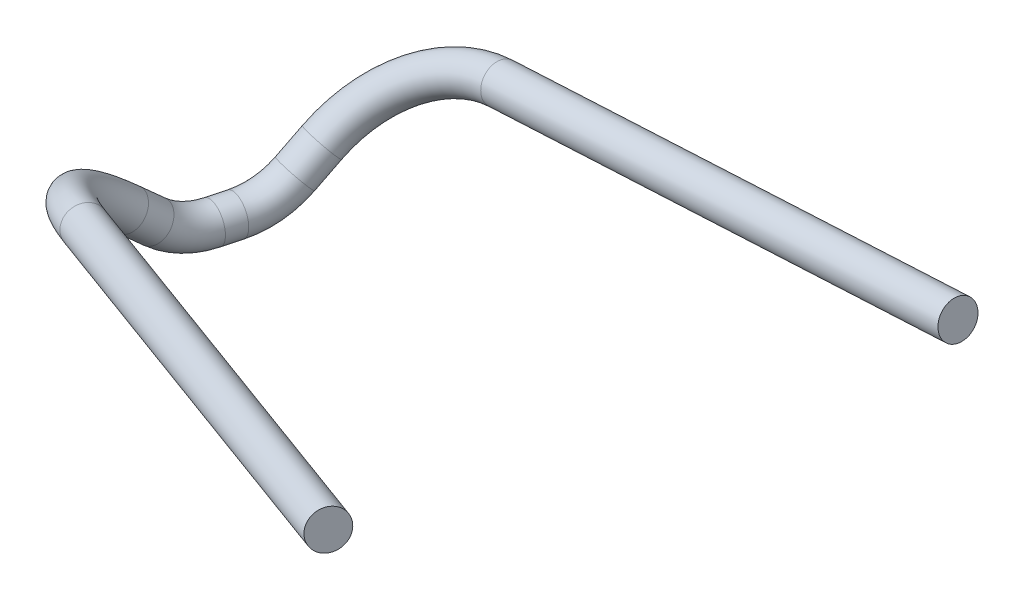
ISO-10303-21;
HEADER;
FILE_DESCRIPTION(('STEP AP214'),'2;1');
FILE_NAME('part.step','',(''),(''),'','','');
FILE_SCHEMA(('AUTOMOTIVE_DESIGN { 1 0 10303 214 1 1 1 1 }'));
ENDSEC;
DATA;
#1=APPLICATION_CONTEXT('core data for automotive mechanical design processes');
#2=APPLICATION_PROTOCOL_DEFINITION('international standard','automotive_design',2000,#1);
#3=PRODUCT_CONTEXT('',#1,'mechanical');
#4=PRODUCT('Part','Part','',(#3));
#5=PRODUCT_RELATED_PRODUCT_CATEGORY('part','',(#4));
#6=PRODUCT_DEFINITION_FORMATION('','',#4);
#7=PRODUCT_DEFINITION_CONTEXT('part definition',#1,'design');
#8=PRODUCT_DEFINITION('design','',#6,#7);
#9=PRODUCT_DEFINITION_SHAPE('','',#8);
#10=(LENGTH_UNIT() NAMED_UNIT(*) SI_UNIT(.MILLI.,.METRE.));
#11=(NAMED_UNIT(*) PLANE_ANGLE_UNIT() SI_UNIT($,.RADIAN.));
#12=(NAMED_UNIT(*) SI_UNIT($,.STERADIAN.) SOLID_ANGLE_UNIT());
#13=UNCERTAINTY_MEASURE_WITH_UNIT(LENGTH_MEASURE(1.E-05),#10,'distance_accuracy_value','');
#14=(GEOMETRIC_REPRESENTATION_CONTEXT(3) GLOBAL_UNCERTAINTY_ASSIGNED_CONTEXT((#13)) GLOBAL_UNIT_ASSIGNED_CONTEXT((#10,
#11,#12)) REPRESENTATION_CONTEXT('',''));
#15=CARTESIAN_POINT('',(0.,0.,0.));
#16=DIRECTION('',(0.,0.,1.));
#17=DIRECTION('',(1.,0.,0.));
#18=AXIS2_PLACEMENT_3D('',#15,#16,#17);
#19=CARTESIAN_POINT('',(-78.0843485405473,-0.522963162736968,86.9618786306305));
#20=DIRECTION('',(0.89717440141334,0.141581533037502,0.418369170651191));
#21=DIRECTION('',(0.128206233000635,-0.989926564709335,0.0600712768514311));
#22=AXIS2_PLACEMENT_3D('',#19,#20,#21);
#23=PLANE('',#22);
#24=CARTESIAN_POINT('',(-78.0843485405473,-0.522963162736968,86.9618786306305));
#25=DIRECTION('',(0.89717440141334,0.141581533037502,0.418369170651191));
#26=DIRECTION('',(0.128206233000635,-0.989926564709335,0.0600712768514311));
#27=AXIS2_PLACEMENT_3D('',#24,#25,#26);
#28=CIRCLE('',#27,0.749999999999999);
#29=CARTESIAN_POINT('',(-77.9881938657968,-1.26540808626897,87.0069320882691));
#30=VERTEX_POINT('',#29);
#31=EDGE_CURVE('E83',#30,#30,#28,.T.);
#32=ORIENTED_EDGE('',*,*,#31,.T.);
#33=EDGE_LOOP('',(#32));
#34=FACE_BOUND('',#33,.T.);
#35=ADVANCED_FACE('F49',(#34),#23,.T.);
#36=CARTESIAN_POINT('',(-72.6491485933944,-0.522963162736745,66.67743627856));
#37=DIRECTION('',(-0.987064277400173,-0.13431820282712,-0.087537035989163));
#38=DIRECTION('',(0.134835801640414,-0.990867956185882,0.));
#39=AXIS2_PLACEMENT_3D('',#36,#37,#38);
#40=PLANE('',#39);
#41=CARTESIAN_POINT('',(-72.6491485933944,-0.522963162736745,66.67743627856));
#42=DIRECTION('',(-0.987064277400173,-0.13431820282712,-0.087537035989163));
#43=DIRECTION('',(0.134835801640414,-0.990867956185882,0.));
#44=AXIS2_PLACEMENT_3D('',#41,#42,#43);
#45=CIRCLE('',#44,0.749999999999999);
#46=CARTESIAN_POINT('',(-72.5480217421641,-1.26611412987616,66.67743627856));
#47=VERTEX_POINT('',#46);
#48=EDGE_CURVE('E11',#47,#47,#45,.T.);
#49=ORIENTED_EDGE('',*,*,#48,.F.);
#50=EDGE_LOOP('',(#49));
#51=FACE_BOUND('',#50,.T.);
#52=ADVANCED_FACE('F91',(#51),#40,.F.);
#53=CARTESIAN_POINT('',(-78.0843485405473,-0.522963162736968,86.9618786306305));
#54=DIRECTION('',(-0.897174401413341,-0.141581533037501,-0.418369170651191));
#55=DIRECTION('',(-0.422626456830694,0.,0.906303965558318));
#56=AXIS2_PLACEMENT_3D('',#53,#54,#55);
#57=CYLINDRICAL_SURFACE('',#56,0.749999999999999);
#58=CARTESIAN_POINT('',(-96.7607761205493,-3.4702577403297,78.2527118230807));
#59=DIRECTION('',(0.89717440141334,0.141581533037502,0.418369170651191));
#60=DIRECTION('',(0.128206233000635,-0.989926564709335,0.0600712768514311));
#61=AXIS2_PLACEMENT_3D('',#58,#59,#60);
#62=CIRCLE('',#61,0.749999999999999);
#63=CARTESIAN_POINT('',(-97.0667856585665,-2.9989681134848,78.749445403857));
#64=VERTEX_POINT('',#63);
#65=EDGE_CURVE('E80',#64,#64,#62,.T.);
#66=ORIENTED_EDGE('',*,*,#65,.T.);
#67=EDGE_LOOP('',(#66));
#68=FACE_BOUND('',#67,.T.);
#69=ORIENTED_EDGE('',*,*,#31,.F.);
#70=EDGE_LOOP('',(#69));
#71=FACE_BOUND('',#70,.T.);
#72=ADVANCED_FACE('F88',(#68,#71),#57,.T.);
#73=CARTESIAN_POINT('',(-94.7207125337679,-6.61218858596242,74.9411546179051));
#74=DIRECTION('',(-0.169126331256122,-0.764908812835371,0.621539051164629));
#75=DIRECTION('',(0.,-0.630623574035153,-0.776088853077488));
#76=AXIS2_PLACEMENT_3D('',#73,#74,#75);
#77=TOROIDAL_SURFACE('',#76,4.99999999999999,0.749999999999999);
#78=CARTESIAN_POINT('',(-99.5482448831357,-6.60263734043155,73.6392943375694));
#79=DIRECTION('',(-0.197973585884879,0.644135745782778,0.738847481078975));
#80=DIRECTION('',(0.481980641490084,-0.592377449517736,0.645587808537048));
#81=AXIS2_PLACEMENT_3D('',#78,#79,#80);
#82=CIRCLE('',#81,0.749999999999999);
#83=CARTESIAN_POINT('',(-100.272374735541,-6.60120465360192,73.4440152955191));
#84=VERTEX_POINT('',#83);
#85=EDGE_CURVE('E77',#84,#84,#82,.T.);
#86=CARTESIAN_POINT('',(-94.7207125337679,-6.61218858596242,74.9411546179051));
#87=DIRECTION('',(-0.169126331256122,-0.764908812835371,0.621539051164629));
#88=DIRECTION('',(0.,-0.630623574035153,-0.776088853077488));
#89=AXIS2_PLACEMENT_3D('',#86,#87,#88);
#90=CIRCLE('',#89,5.74999999999999);
#91=EDGE_CURVE('',#64,#84,#90,.T.);
#92=ORIENTED_EDGE('',*,*,#65,.F.);
#93=ORIENTED_EDGE('',*,*,#85,.T.);
#94=ORIENTED_EDGE('',*,*,#91,.T.);
#95=ORIENTED_EDGE('',*,*,#91,.F.);
#96=EDGE_LOOP('',(#92,#94,#93,#95));
#97=FACE_BOUND('',#96,.T.);
#98=ADVANCED_FACE('F90',(#97),#77,.T.);
#99=CARTESIAN_POINT('',(-99.5482448831357,-6.60263734043157,73.6392943375695));
#100=DIRECTION('',(0.197973585884887,-0.644135745782779,-0.738847481078972));
#101=DIRECTION('',(0.,0.753766513911076,-0.657142330478218));
#102=AXIS2_PLACEMENT_3D('',#99,#100,#101);
#103=CYLINDRICAL_SURFACE('',#102,0.749999999999999);
#104=CARTESIAN_POINT('',(-99.3284730760856,-7.31769675708799,72.8190947875874));
#105=DIRECTION('',(-0.197973585884887,0.644135745782779,0.738847481078972));
#106=DIRECTION('',(0.481980641490083,-0.592377449517732,0.645587808537053));
#107=AXIS2_PLACEMENT_3D('',#104,#105,#106);
#108=CIRCLE('',#107,0.749999999999999);
#109=CARTESIAN_POINT('',(-99.4535090250655,-7.89138015567576,73.2857353019531));
#110=VERTEX_POINT('',#109);
#111=EDGE_CURVE('E74',#110,#110,#108,.T.);
#112=ORIENTED_EDGE('',*,*,#111,.T.);
#113=EDGE_LOOP('',(#112));
#114=FACE_BOUND('',#113,.T.);
#115=ORIENTED_EDGE('',*,*,#85,.F.);
#116=EDGE_LOOP('',(#115));
#117=FACE_BOUND('',#116,.T.);
#118=ADVANCED_FACE('F98',(#114,#117),#103,.T.);
#119=CARTESIAN_POINT('',(-98.828329280166,-5.02296316273685,70.9525327301247));
#120=DIRECTION('',(0.965925826289071,0.,0.258819045102512));
#121=DIRECTION('',(0.258819045102512,0.,-0.965925826289071));
#122=AXIS2_PLACEMENT_3D('',#119,#120,#121);
#123=TOROIDAL_SURFACE('',#122,2.99999999999999,0.749999999999999);
#124=CARTESIAN_POINT('',(-98.8283292801659,-8.02296316273685,70.9525327301247));
#125=DIRECTION('',(-0.258819045102513,0.,0.96592582628907));
#126=DIRECTION('',(0.611091012710674,-0.774439504841824,0.163741343357724));
#127=AXIS2_PLACEMENT_3D('',#124,#125,#126);
#128=CIRCLE('',#127,0.749999999999999);
#129=CARTESIAN_POINT('',(-98.8283292801659,-8.77296316273684,70.9525327301247));
#130=VERTEX_POINT('',#129);
#131=EDGE_CURVE('E71',#130,#130,#128,.T.);
#132=CARTESIAN_POINT('',(-98.828329280166,-5.02296316273685,70.9525327301247));
#133=DIRECTION('',(0.965925826289071,0.,0.258819045102512));
#134=DIRECTION('',(0.258819045102512,0.,-0.965925826289071));
#135=AXIS2_PLACEMENT_3D('',#132,#133,#134);
#136=CIRCLE('',#135,3.74999999999999);
#137=EDGE_CURVE('',#110,#130,#136,.T.);
#138=ORIENTED_EDGE('',*,*,#111,.F.);
#139=ORIENTED_EDGE('',*,*,#131,.T.);
#140=ORIENTED_EDGE('',*,*,#137,.T.);
#141=ORIENTED_EDGE('',*,*,#137,.F.);
#142=EDGE_LOOP('',(#138,#140,#139,#141));
#143=FACE_BOUND('',#142,.T.);
#144=ADVANCED_FACE('F123',(#143),#123,.T.);
#145=CARTESIAN_POINT('',(-98.8283292801659,-8.02296316273685,70.9525327301247));
#146=DIRECTION('',(0.258819045102514,0.,-0.96592582628907));
#147=DIRECTION('',(-0.96592582628907,0.,-0.258819045102514));
#148=AXIS2_PLACEMENT_3D('',#145,#146,#147);
#149=CYLINDRICAL_SURFACE('',#148,0.749999999999999);
#150=CARTESIAN_POINT('',(-98.6271221043037,-8.02296316273684,70.2016173269593));
#151=DIRECTION('',(-0.258819045102515,0.,0.96592582628907));
#152=DIRECTION('',(0.611091012710672,-0.774439504841824,0.16374134335773));
#153=AXIS2_PLACEMENT_3D('',#150,#151,#152);
#154=CIRCLE('',#153,0.749999999999999);
#155=CARTESIAN_POINT('',(-98.6271221043037,-8.77296316273683,70.2016173269592));
#156=VERTEX_POINT('',#155);
#157=EDGE_CURVE('E68',#156,#156,#154,.T.);
#158=ORIENTED_EDGE('',*,*,#157,.T.);
#159=EDGE_LOOP('',(#158));
#160=FACE_BOUND('',#159,.T.);
#161=ORIENTED_EDGE('',*,*,#131,.F.);
#162=EDGE_LOOP('',(#161));
#163=FACE_BOUND('',#162,.T.);
#164=ADVANCED_FACE('F119',(#160,#163),#149,.T.);
#165=CARTESIAN_POINT('',(-98.6271221043037,-5.02296316273684,70.2016173269593));
#166=DIRECTION('',(0.965925826289071,0.,0.258819045102512));
#167=DIRECTION('',(0.258819045102512,0.,-0.965925826289071));
#168=AXIS2_PLACEMENT_3D('',#165,#166,#167);
#169=TOROIDAL_SURFACE('',#168,2.99999999999999,0.749999999999999);
#170=CARTESIAN_POINT('',(-98.1156554766658,-7.28013179435028,68.2927978862387));
#171=DIRECTION('',(-0.194732743289845,-0.658718433227258,0.72675249185499));
#172=DIRECTION('',(0.743124333327677,-0.582680185803734,-0.329013717476979));
#173=AXIS2_PLACEMENT_3D('',#170,#171,#172);
#174=CIRCLE('',#173,0.749999999999999);
#175=CARTESIAN_POINT('',(-97.9877888197563,-7.84442395225363,67.8155930260585));
#176=VERTEX_POINT('',#175);
#177=EDGE_CURVE('E63',#176,#176,#174,.T.);
#178=CARTESIAN_POINT('',(-98.6271221043037,-5.02296316273684,70.2016173269593));
#179=DIRECTION('',(0.965925826289071,0.,0.258819045102512));
#180=DIRECTION('',(0.258819045102512,0.,-0.965925826289071));
#181=AXIS2_PLACEMENT_3D('',#178,#179,#180);
#182=CIRCLE('',#181,3.74999999999999);
#183=EDGE_CURVE('',#156,#176,#182,.T.);
#184=ORIENTED_EDGE('',*,*,#157,.F.);
#185=ORIENTED_EDGE('',*,*,#177,.T.);
#186=ORIENTED_EDGE('',*,*,#183,.T.);
#187=ORIENTED_EDGE('',*,*,#183,.F.);
#188=EDGE_LOOP('',(#184,#186,#185,#187));
#189=FACE_BOUND('',#188,.T.);
#190=ADVANCED_FACE('F115',(#189),#169,.T.);
#191=CARTESIAN_POINT('',(-98.1156554766658,-7.28013179435026,68.2927978862386));
#192=DIRECTION('',(0.194732743289849,0.658718433227246,-0.726752491855));
#193=DIRECTION('',(0.,0.740936733143859,0.671574833862992));
#194=AXIS2_PLACEMENT_3D('',#191,#192,#193);
#195=CYLINDRICAL_SURFACE('',#194,0.749999999999999);
#196=CARTESIAN_POINT('',(-97.8826844088612,-6.49206536967555,67.4233380244982));
#197=DIRECTION('',(-0.194732743289849,-0.658718433227246,0.726752491855));
#198=DIRECTION('',(0.743124333327674,-0.582680185803743,-0.329013717476969));
#199=AXIS2_PLACEMENT_3D('',#196,#197,#198);
#200=CIRCLE('',#199,0.749999999999999);
#201=CARTESIAN_POINT('',(-98.6085881174232,-6.48540222987351,67.2348720900063));
#202=VERTEX_POINT('',#201);
#203=EDGE_CURVE('E59',#202,#202,#200,.T.);
#204=ORIENTED_EDGE('',*,*,#203,.T.);
#205=EDGE_LOOP('',(#204));
#206=FACE_BOUND('',#205,.T.);
#207=ORIENTED_EDGE('',*,*,#177,.F.);
#208=EDGE_LOOP('',(#207));
#209=FACE_BOUND('',#208,.T.);
#210=ADVANCED_FACE('F109',(#206,#209),#195,.T.);
#211=CARTESIAN_POINT('',(-93.0433263517812,-6.53648630168915,68.6797775877777));
#212=DIRECTION('',(0.159071375507353,-0.752337089979354,-0.63928491342718));
#213=DIRECTION('',(0.,0.647529855921315,-0.762040081419948));
#214=AXIS2_PLACEMENT_3D('',#211,#212,#213);
#215=TOROIDAL_SURFACE('',#214,4.99999999999998,0.749999999999999);
#216=CARTESIAN_POINT('',(-93.1433775605036,-3.31178661245187,64.8599213509719));
#217=DIRECTION('',(-0.987064277400173,-0.13431820282712,-0.087537035989163));
#218=DIRECTION('',(0.134835801640414,-0.990867956185882,0.));
#219=AXIS2_PLACEMENT_3D('',#216,#217,#218);
#220=CIRCLE('',#219,0.749999999999999);
#221=CARTESIAN_POINT('',(-93.158385241812,-2.82808165906614,64.2869429154508));
#222=VERTEX_POINT('',#221);
#223=EDGE_CURVE('E55',#222,#222,#220,.T.);
#224=CARTESIAN_POINT('',(-93.0433263517812,-6.53648630168915,68.6797775877777));
#225=DIRECTION('',(0.159071375507353,-0.752337089979354,-0.63928491342718));
#226=DIRECTION('',(0.,0.647529855921315,-0.762040081419948));
#227=AXIS2_PLACEMENT_3D('',#224,#225,#226);
#228=CIRCLE('',#227,5.74999999999998);
#229=EDGE_CURVE('',#202,#222,#228,.T.);
#230=ORIENTED_EDGE('',*,*,#203,.F.);
#231=ORIENTED_EDGE('',*,*,#223,.T.);
#232=ORIENTED_EDGE('',*,*,#229,.T.);
#233=ORIENTED_EDGE('',*,*,#229,.F.);
#234=EDGE_LOOP('',(#230,#232,#231,#233));
#235=FACE_BOUND('',#234,.T.);
#236=ADVANCED_FACE('F104',(#235),#215,.T.);
#237=CARTESIAN_POINT('',(-93.1433775605038,-3.31178661245178,64.8599213509717));
#238=DIRECTION('',(0.987064277400173,0.13431820282712,0.0875370359891626));
#239=DIRECTION('',(-0.134835801640415,0.990867956185882,0.));
#240=AXIS2_PLACEMENT_3D('',#237,#238,#239);
#241=CYLINDRICAL_SURFACE('',#240,0.749999999999999);
#242=ORIENTED_EDGE('',*,*,#48,.T.);
#243=EDGE_LOOP('',(#242));
#244=FACE_BOUND('',#243,.T.);
#245=ORIENTED_EDGE('',*,*,#223,.F.);
#246=EDGE_LOOP('',(#245));
#247=FACE_BOUND('',#246,.T.);
#248=ADVANCED_FACE('F102',(#244,#247),#241,.T.);
#249=CLOSED_SHELL('',(#35,#52,#72,#98,#118,#144,#164,#190,#210,#236,#248));
#250=MANIFOLD_SOLID_BREP('B2',#249);
#251=ADVANCED_BREP_SHAPE_REPRESENTATION('',(#18,#250),#14);
#252=SHAPE_DEFINITION_REPRESENTATION(#9,#251);
ENDSEC;
END-ISO-10303-21;
